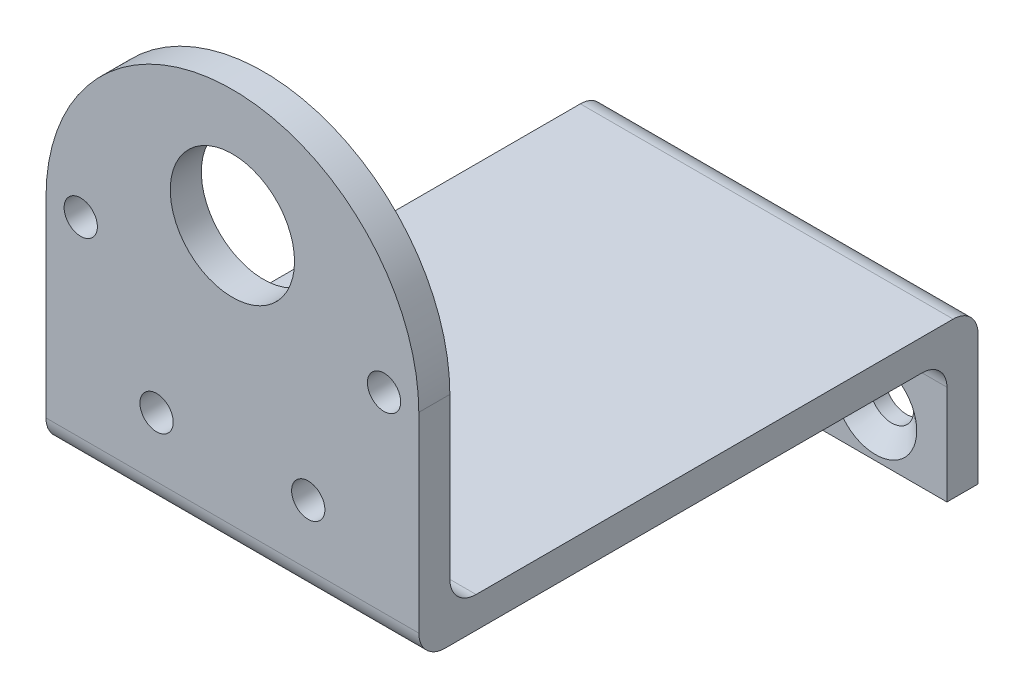
ISO-10303-21;
HEADER;
FILE_DESCRIPTION(('STEP AP214'),'2;1');
FILE_NAME('part.step','',(''),(''),'','','');
FILE_SCHEMA(('AUTOMOTIVE_DESIGN { 1 0 10303 214 1 1 1 1 }'));
ENDSEC;
DATA;
#1=APPLICATION_CONTEXT('core data for automotive mechanical design processes');
#2=APPLICATION_PROTOCOL_DEFINITION('international standard','automotive_design',2000,#1);
#3=PRODUCT_CONTEXT('',#1,'mechanical');
#4=PRODUCT('Part','Part','',(#3));
#5=PRODUCT_RELATED_PRODUCT_CATEGORY('part','',(#4));
#6=PRODUCT_DEFINITION_FORMATION('','',#4);
#7=PRODUCT_DEFINITION_CONTEXT('part definition',#1,'design');
#8=PRODUCT_DEFINITION('design','',#6,#7);
#9=PRODUCT_DEFINITION_SHAPE('','',#8);
#10=(LENGTH_UNIT() NAMED_UNIT(*) SI_UNIT(.MILLI.,.METRE.));
#11=(NAMED_UNIT(*) PLANE_ANGLE_UNIT() SI_UNIT($,.RADIAN.));
#12=(NAMED_UNIT(*) SI_UNIT($,.STERADIAN.) SOLID_ANGLE_UNIT());
#13=UNCERTAINTY_MEASURE_WITH_UNIT(LENGTH_MEASURE(1.E-05),#10,'distance_accuracy_value','');
#14=(GEOMETRIC_REPRESENTATION_CONTEXT(3) GLOBAL_UNCERTAINTY_ASSIGNED_CONTEXT((#13)) GLOBAL_UNIT_ASSIGNED_CONTEXT((#10,
#11,#12)) REPRESENTATION_CONTEXT('',''));
#15=CARTESIAN_POINT('',(0.,0.,0.));
#16=DIRECTION('',(0.,0.,1.));
#17=DIRECTION('',(1.,0.,0.));
#18=AXIS2_PLACEMENT_3D('',#15,#16,#17);
#19=CARTESIAN_POINT('',(38.1,42.094372260743,3.175));
#20=DIRECTION('',(0.,0.,-1.));
#21=DIRECTION('',(0.,1.,0.));
#22=AXIS2_PLACEMENT_3D('',#19,#20,#21);
#23=PLANE('',#22);
#24=CARTESIAN_POINT('',(3.55000000000001,23.044372260743,3.175));
#25=DIRECTION('',(0.,0.,1.));
#26=DIRECTION('',(1.,0.,0.));
#27=AXIS2_PLACEMENT_3D('',#24,#25,#26);
#28=CIRCLE('',#27,1.69999999999999);
#29=CARTESIAN_POINT('',(5.25,23.044372260743,3.175));
#30=VERTEX_POINT('',#29);
#31=EDGE_CURVE('E277',#30,#30,#28,.T.);
#32=ORIENTED_EDGE('',*,*,#31,.F.);
#33=EDGE_LOOP('',(#32));
#34=FACE_BOUND('',#33,.T.);
#35=CARTESIAN_POINT('',(34.55,23.0443722607431,3.175));
#36=DIRECTION('',(0.,0.,1.));
#37=DIRECTION('',(1.,0.,0.));
#38=AXIS2_PLACEMENT_3D('',#35,#36,#37);
#39=CIRCLE('',#38,1.69999999999999);
#40=CARTESIAN_POINT('',(36.25,23.0443722607431,3.175));
#41=VERTEX_POINT('',#40);
#42=EDGE_CURVE('E267',#41,#41,#39,.T.);
#43=ORIENTED_EDGE('',*,*,#42,.F.);
#44=EDGE_LOOP('',(#43));
#45=FACE_BOUND('',#44,.T.);
#46=CARTESIAN_POINT('',(26.8000000000001,9.62097850208426,3.175));
#47=DIRECTION('',(0.,0.,1.));
#48=DIRECTION('',(1.,0.,0.));
#49=AXIS2_PLACEMENT_3D('',#46,#47,#48);
#50=CIRCLE('',#49,1.69999999999999);
#51=CARTESIAN_POINT('',(28.5,9.62097850208426,3.175));
#52=VERTEX_POINT('',#51);
#53=EDGE_CURVE('E264',#52,#52,#50,.T.);
#54=ORIENTED_EDGE('',*,*,#53,.F.);
#55=EDGE_LOOP('',(#54));
#56=FACE_BOUND('',#55,.T.);
#57=CARTESIAN_POINT('',(11.3,9.62097850208421,3.175));
#58=DIRECTION('',(0.,0.,1.));
#59=DIRECTION('',(1.,0.,0.));
#60=AXIS2_PLACEMENT_3D('',#57,#58,#59);
#61=CIRCLE('',#60,1.69999999999999);
#62=CARTESIAN_POINT('',(13.,9.62097850208421,3.175));
#63=VERTEX_POINT('',#62);
#64=EDGE_CURVE('E263',#63,#63,#61,.T.);
#65=ORIENTED_EDGE('',*,*,#64,.F.);
#66=EDGE_LOOP('',(#65));
#67=FACE_BOUND('',#66,.T.);
#68=CARTESIAN_POINT('',(19.05,30.044372260743,3.17499999999999));
#69=DIRECTION('',(0.,0.,1.));
#70=DIRECTION('',(1.,0.,0.));
#71=AXIS2_PLACEMENT_3D('',#68,#69,#70);
#72=CIRCLE('',#71,6.35);
#73=CARTESIAN_POINT('',(25.4,30.044372260743,3.17499999999999));
#74=VERTEX_POINT('',#73);
#75=EDGE_CURVE('E260',#74,#74,#72,.T.);
#76=ORIENTED_EDGE('',*,*,#75,.F.);
#77=EDGE_LOOP('',(#76));
#78=FACE_BOUND('',#77,.T.);
#79=DIRECTION('',(0.,-1.,0.));
#80=VECTOR('',#79,1.);
#81=CARTESIAN_POINT('',(38.1,42.094372260743,3.175));
#82=LINE('',#81,#80);
#83=CARTESIAN_POINT('',(38.1,23.044372260743,3.17499999999999));
#84=VERTEX_POINT('',#83);
#85=CARTESIAN_POINT('',(38.1,3.50032880236569,3.17499999999999));
#86=VERTEX_POINT('',#85);
#87=EDGE_CURVE('E157',#84,#86,#82,.T.);
#88=ORIENTED_EDGE('',*,*,#87,.F.);
#89=CARTESIAN_POINT('',(19.05,23.044372260743,3.17499999999999));
#90=DIRECTION('',(0.,0.,1.));
#91=DIRECTION('',(1.,0.,0.));
#92=AXIS2_PLACEMENT_3D('',#89,#90,#91);
#93=CIRCLE('',#92,19.05);
#94=CARTESIAN_POINT('',(0.,23.044372260743,3.17499999999999));
#95=VERTEX_POINT('',#94);
#96=EDGE_CURVE('E259',#84,#95,#93,.T.);
#97=ORIENTED_EDGE('',*,*,#96,.T.);
#98=DIRECTION('',(0.,-1.,0.));
#99=VECTOR('',#98,1.);
#100=CARTESIAN_POINT('',(0.,42.094372260743,3.175));
#101=LINE('',#100,#99);
#102=CARTESIAN_POINT('',(0.,3.50032880236569,3.17499999999999));
#103=VERTEX_POINT('',#102);
#104=EDGE_CURVE('E212',#95,#103,#101,.T.);
#105=ORIENTED_EDGE('',*,*,#104,.T.);
#106=DIRECTION('',(-1.,0.,0.));
#107=VECTOR('',#106,1.);
#108=CARTESIAN_POINT('',(38.1,3.50032880236569,3.17499999999999));
#109=LINE('',#108,#107);
#110=EDGE_CURVE('E252',#86,#103,#109,.T.);
#111=ORIENTED_EDGE('',*,*,#110,.F.);
#112=EDGE_LOOP('',(#88,#97,#105,#111));
#113=FACE_BOUND('',#112,.T.);
#114=ADVANCED_FACE('F86',(#34,#45,#56,#67,#78,#113),#23,.F.);
#115=CARTESIAN_POINT('',(38.1,42.094372260743,0.));
#116=DIRECTION('',(0.,0.,-1.));
#117=DIRECTION('',(0.,1.,0.));
#118=AXIS2_PLACEMENT_3D('',#115,#116,#117);
#119=PLANE('',#118);
#120=CARTESIAN_POINT('',(3.55000000000001,23.044372260743,0.));
#121=DIRECTION('',(0.,0.,-1.));
#122=DIRECTION('',(0.,1.,0.));
#123=AXIS2_PLACEMENT_3D('',#120,#121,#122);
#124=CIRCLE('',#123,1.69999999999999);
#125=CARTESIAN_POINT('',(3.55000000000001,24.744372260743,0.));
#126=VERTEX_POINT('',#125);
#127=EDGE_CURVE('E89',#126,#126,#124,.T.);
#128=ORIENTED_EDGE('',*,*,#127,.F.);
#129=EDGE_LOOP('',(#128));
#130=FACE_BOUND('',#129,.T.);
#131=CARTESIAN_POINT('',(34.55,23.0443722607431,0.));
#132=DIRECTION('',(0.,0.,-1.));
#133=DIRECTION('',(0.,1.,0.));
#134=AXIS2_PLACEMENT_3D('',#131,#132,#133);
#135=CIRCLE('',#134,1.69999999999999);
#136=CARTESIAN_POINT('',(34.55,24.7443722607431,0.));
#137=VERTEX_POINT('',#136);
#138=EDGE_CURVE('E265',#137,#137,#135,.T.);
#139=ORIENTED_EDGE('',*,*,#138,.F.);
#140=EDGE_LOOP('',(#139));
#141=FACE_BOUND('',#140,.T.);
#142=CARTESIAN_POINT('',(26.8000000000001,9.62097850208426,0.));
#143=DIRECTION('',(0.,0.,-1.));
#144=DIRECTION('',(0.,1.,0.));
#145=AXIS2_PLACEMENT_3D('',#142,#143,#144);
#146=CIRCLE('',#145,1.69999999999999);
#147=CARTESIAN_POINT('',(26.8000000000001,11.3209785020843,0.));
#148=VERTEX_POINT('',#147);
#149=EDGE_CURVE('E261',#148,#148,#146,.T.);
#150=ORIENTED_EDGE('',*,*,#149,.F.);
#151=EDGE_LOOP('',(#150));
#152=FACE_BOUND('',#151,.T.);
#153=CARTESIAN_POINT('',(11.3,9.62097850208421,0.));
#154=DIRECTION('',(0.,0.,-1.));
#155=DIRECTION('',(0.,1.,0.));
#156=AXIS2_PLACEMENT_3D('',#153,#154,#155);
#157=CIRCLE('',#156,1.69999999999999);
#158=CARTESIAN_POINT('',(11.3,11.3209785020842,0.));
#159=VERTEX_POINT('',#158);
#160=EDGE_CURVE('E282',#159,#159,#157,.T.);
#161=ORIENTED_EDGE('',*,*,#160,.F.);
#162=EDGE_LOOP('',(#161));
#163=FACE_BOUND('',#162,.T.);
#164=CARTESIAN_POINT('',(19.05,30.044372260743,0.));
#165=DIRECTION('',(0.,0.,-1.));
#166=DIRECTION('',(0.,1.,0.));
#167=AXIS2_PLACEMENT_3D('',#164,#165,#166);
#168=CIRCLE('',#167,6.35);
#169=CARTESIAN_POINT('',(19.05,36.394372260743,0.));
#170=VERTEX_POINT('',#169);
#171=EDGE_CURVE('E256',#170,#170,#168,.T.);
#172=ORIENTED_EDGE('',*,*,#171,.F.);
#173=EDGE_LOOP('',(#172));
#174=FACE_BOUND('',#173,.T.);
#175=CARTESIAN_POINT('',(19.05,23.044372260743,0.));
#176=DIRECTION('',(0.,0.,-1.));
#177=DIRECTION('',(0.,1.,0.));
#178=AXIS2_PLACEMENT_3D('',#175,#176,#177);
#179=CIRCLE('',#178,19.05);
#180=CARTESIAN_POINT('',(0.,23.044372260743,0.));
#181=VERTEX_POINT('',#180);
#182=CARTESIAN_POINT('',(38.1,23.044372260743,0.));
#183=VERTEX_POINT('',#182);
#184=EDGE_CURVE('E102',#181,#183,#179,.T.);
#185=ORIENTED_EDGE('',*,*,#184,.T.);
#186=DIRECTION('',(0.,-1.,0.));
#187=VECTOR('',#186,1.);
#188=CARTESIAN_POINT('',(38.1,42.094372260743,0.));
#189=LINE('',#188,#187);
#190=CARTESIAN_POINT('',(38.1,6.6753288023657,0.));
#191=VERTEX_POINT('',#190);
#192=EDGE_CURVE('E110',#183,#191,#189,.T.);
#193=ORIENTED_EDGE('',*,*,#192,.T.);
#194=DIRECTION('',(-1.,0.,0.));
#195=VECTOR('',#194,1.);
#196=CARTESIAN_POINT('',(38.1,6.6753288023657,0.));
#197=LINE('',#196,#195);
#198=CARTESIAN_POINT('',(0.,6.6753288023657,0.));
#199=VERTEX_POINT('',#198);
#200=EDGE_CURVE('E211',#191,#199,#197,.T.);
#201=ORIENTED_EDGE('',*,*,#200,.T.);
#202=DIRECTION('',(0.,-1.,0.));
#203=VECTOR('',#202,1.);
#204=CARTESIAN_POINT('',(0.,42.094372260743,0.));
#205=LINE('',#204,#203);
#206=EDGE_CURVE('E150',#181,#199,#205,.T.);
#207=ORIENTED_EDGE('',*,*,#206,.F.);
#208=EDGE_LOOP('',(#185,#193,#201,#207));
#209=FACE_BOUND('',#208,.T.);
#210=ADVANCED_FACE('F366',(#130,#141,#152,#163,#174,#209),#119,.T.);
#211=CARTESIAN_POINT('',(38.1,3.50032880236569,0.494043458377322));
#212=DIRECTION('',(1.,0.,0.));
#213=DIRECTION('',(0.,0.,-1.));
#214=AXIS2_PLACEMENT_3D('',#211,#212,#213);
#215=PLANE('',#214);
#216=ORIENTED_EDGE('',*,*,#192,.F.);
#217=DIRECTION('',(0.,0.,1.));
#218=VECTOR('',#217,1.);
#219=CARTESIAN_POINT('',(38.1,23.044372260743,-53.975));
#220=LINE('',#219,#218);
#221=EDGE_CURVE('E12',#183,#84,#220,.T.);
#222=ORIENTED_EDGE('',*,*,#221,.T.);
#223=ORIENTED_EDGE('',*,*,#87,.T.);
#224=CARTESIAN_POINT('',(38.1,3.50032880236569,0.494043458377322));
#225=DIRECTION('',(1.,0.,0.));
#226=DIRECTION('',(0.,0.,-1.));
#227=AXIS2_PLACEMENT_3D('',#224,#225,#226);
#228=CIRCLE('',#227,2.68095654162267);
#229=CARTESIAN_POINT('',(38.1,0.81937226074302,0.494043458377322));
#230=VERTEX_POINT('',#229);
#231=EDGE_CURVE('E308',#86,#230,#228,.T.);
#232=ORIENTED_EDGE('',*,*,#231,.T.);
#233=DIRECTION('',(0.,0.,-1.));
#234=VECTOR('',#233,1.);
#235=CARTESIAN_POINT('',(38.1,0.81937226074302,0.494043458377322));
#236=LINE('',#235,#234);
#237=CARTESIAN_POINT('',(38.1,0.819372260743023,-48.26));
#238=VERTEX_POINT('',#237);
#239=EDGE_CURVE('E310',#230,#238,#236,.T.);
#240=ORIENTED_EDGE('',*,*,#239,.T.);
#241=CARTESIAN_POINT('',(38.1,-1.72062773925698,-48.26));
#242=DIRECTION('',(-1.,0.,0.));
#243=DIRECTION('',(0.,0.,1.));
#244=AXIS2_PLACEMENT_3D('',#241,#242,#243);
#245=CIRCLE('',#244,2.54);
#246=CARTESIAN_POINT('',(38.1,-1.72062773925698,-50.8));
#247=VERTEX_POINT('',#246);
#248=EDGE_CURVE('E312',#238,#247,#245,.T.);
#249=ORIENTED_EDGE('',*,*,#248,.T.);
#250=DIRECTION('',(0.,1.,0.));
#251=VECTOR('',#250,1.);
#252=CARTESIAN_POINT('',(38.1,-11.880627739257,-50.8));
#253=LINE('',#252,#251);
#254=CARTESIAN_POINT('',(38.1,-11.880627739257,-50.8));
#255=VERTEX_POINT('',#254);
#256=EDGE_CURVE('E314',#255,#247,#253,.T.);
#257=ORIENTED_EDGE('',*,*,#256,.F.);
#258=DIRECTION('',(0.,0.,1.));
#259=VECTOR('',#258,1.);
#260=CARTESIAN_POINT('',(38.1,-11.880627739257,-53.975));
#261=LINE('',#260,#259);
#262=CARTESIAN_POINT('',(38.1,-11.880627739257,-53.975));
#263=VERTEX_POINT('',#262);
#264=EDGE_CURVE('E317',#263,#255,#261,.T.);
#265=ORIENTED_EDGE('',*,*,#264,.F.);
#266=DIRECTION('',(0.,-1.,0.));
#267=VECTOR('',#266,1.);
#268=CARTESIAN_POINT('',(38.1,1.45437226074302,-53.975));
#269=LINE('',#268,#267);
#270=CARTESIAN_POINT('',(38.1,1.45437226074302,-53.975));
#271=VERTEX_POINT('',#270);
#272=EDGE_CURVE('E202',#271,#263,#269,.T.);
#273=ORIENTED_EDGE('',*,*,#272,.F.);
#274=CARTESIAN_POINT('',(38.1,1.45437226074302,-51.435));
#275=DIRECTION('',(-1.,0.,0.));
#276=DIRECTION('',(0.,0.,1.));
#277=AXIS2_PLACEMENT_3D('',#274,#275,#276);
#278=CIRCLE('',#277,2.54);
#279=CARTESIAN_POINT('',(38.1,3.99437226074302,-51.435));
#280=VERTEX_POINT('',#279);
#281=EDGE_CURVE('E184',#280,#271,#278,.T.);
#282=ORIENTED_EDGE('',*,*,#281,.F.);
#283=DIRECTION('',(0.,0.,-1.));
#284=VECTOR('',#283,1.);
#285=CARTESIAN_POINT('',(38.1,3.99437226074302,-2.68095654162268));
#286=LINE('',#285,#284);
#287=CARTESIAN_POINT('',(38.1,3.99437226074302,-2.68095654162268));
#288=VERTEX_POINT('',#287);
#289=EDGE_CURVE('E198',#288,#280,#286,.T.);
#290=ORIENTED_EDGE('',*,*,#289,.F.);
#291=CARTESIAN_POINT('',(38.1,6.6753288023657,-2.68095654162268));
#292=DIRECTION('',(1.,0.,0.));
#293=DIRECTION('',(0.,0.,-1.));
#294=AXIS2_PLACEMENT_3D('',#291,#292,#293);
#295=CIRCLE('',#294,2.68095654162267);
#296=EDGE_CURVE('E205',#191,#288,#295,.T.);
#297=ORIENTED_EDGE('',*,*,#296,.F.);
#298=EDGE_LOOP('',(#216,#222,#223,#232,#240,#249,#257,#265,#273,#282,#290,#297));
#299=FACE_BOUND('',#298,.T.);
#300=ADVANCED_FACE('F196',(#299),#215,.T.);
#301=CARTESIAN_POINT('',(0.,3.50032880236569,0.494043458377322));
#302=DIRECTION('',(1.,0.,0.));
#303=DIRECTION('',(0.,0.,-1.));
#304=AXIS2_PLACEMENT_3D('',#301,#302,#303);
#305=PLANE('',#304);
#306=DIRECTION('',(0.,0.,1.));
#307=VECTOR('',#306,1.);
#308=CARTESIAN_POINT('',(0.,23.044372260743,-53.975));
#309=LINE('',#308,#307);
#310=EDGE_CURVE('E94',#181,#95,#309,.T.);
#311=ORIENTED_EDGE('',*,*,#310,.F.);
#312=ORIENTED_EDGE('',*,*,#206,.T.);
#313=CARTESIAN_POINT('',(0.,6.6753288023657,-2.68095654162268));
#314=DIRECTION('',(1.,0.,0.));
#315=DIRECTION('',(0.,0.,-1.));
#316=AXIS2_PLACEMENT_3D('',#313,#314,#315);
#317=CIRCLE('',#316,2.68095654162267);
#318=CARTESIAN_POINT('',(0.,3.99437226074302,-2.68095654162268));
#319=VERTEX_POINT('',#318);
#320=EDGE_CURVE('E234',#199,#319,#317,.T.);
#321=ORIENTED_EDGE('',*,*,#320,.T.);
#322=DIRECTION('',(0.,0.,-1.));
#323=VECTOR('',#322,1.);
#324=CARTESIAN_POINT('',(0.,3.99437226074302,-2.68095654162268));
#325=LINE('',#324,#323);
#326=CARTESIAN_POINT('',(0.,3.99437226074302,-51.435));
#327=VERTEX_POINT('',#326);
#328=EDGE_CURVE('E232',#319,#327,#325,.T.);
#329=ORIENTED_EDGE('',*,*,#328,.T.);
#330=CARTESIAN_POINT('',(0.,1.45437226074302,-51.435));
#331=DIRECTION('',(-1.,0.,0.));
#332=DIRECTION('',(0.,0.,1.));
#333=AXIS2_PLACEMENT_3D('',#330,#331,#332);
#334=CIRCLE('',#333,2.54);
#335=CARTESIAN_POINT('',(0.,1.45437226074302,-53.975));
#336=VERTEX_POINT('',#335);
#337=EDGE_CURVE('E186',#327,#336,#334,.T.);
#338=ORIENTED_EDGE('',*,*,#337,.T.);
#339=DIRECTION('',(0.,-1.,0.));
#340=VECTOR('',#339,1.);
#341=CARTESIAN_POINT('',(0.,1.45437226074302,-53.975));
#342=LINE('',#341,#340);
#343=CARTESIAN_POINT('',(0.,-11.880627739257,-53.975));
#344=VERTEX_POINT('',#343);
#345=EDGE_CURVE('E228',#336,#344,#342,.T.);
#346=ORIENTED_EDGE('',*,*,#345,.T.);
#347=DIRECTION('',(0.,0.,1.));
#348=VECTOR('',#347,1.);
#349=CARTESIAN_POINT('',(0.,-11.880627739257,-53.975));
#350=LINE('',#349,#348);
#351=CARTESIAN_POINT('',(0.,-11.880627739257,-50.8));
#352=VERTEX_POINT('',#351);
#353=EDGE_CURVE('E225',#344,#352,#350,.T.);
#354=ORIENTED_EDGE('',*,*,#353,.T.);
#355=DIRECTION('',(0.,1.,0.));
#356=VECTOR('',#355,1.);
#357=CARTESIAN_POINT('',(0.,-11.880627739257,-50.8));
#358=LINE('',#357,#356);
#359=CARTESIAN_POINT('',(0.,-1.72062773925698,-50.8));
#360=VERTEX_POINT('',#359);
#361=EDGE_CURVE('E222',#352,#360,#358,.T.);
#362=ORIENTED_EDGE('',*,*,#361,.T.);
#363=CARTESIAN_POINT('',(0.,-1.72062773925698,-48.26));
#364=DIRECTION('',(-1.,0.,0.));
#365=DIRECTION('',(0.,0.,1.));
#366=AXIS2_PLACEMENT_3D('',#363,#364,#365);
#367=CIRCLE('',#366,2.54);
#368=CARTESIAN_POINT('',(0.,0.819372260743023,-48.26));
#369=VERTEX_POINT('',#368);
#370=EDGE_CURVE('E219',#369,#360,#367,.T.);
#371=ORIENTED_EDGE('',*,*,#370,.F.);
#372=DIRECTION('',(0.,0.,-1.));
#373=VECTOR('',#372,1.);
#374=CARTESIAN_POINT('',(0.,0.81937226074302,0.494043458377322));
#375=LINE('',#374,#373);
#376=CARTESIAN_POINT('',(0.,0.81937226074302,0.494043458377322));
#377=VERTEX_POINT('',#376);
#378=EDGE_CURVE('E217',#377,#369,#375,.T.);
#379=ORIENTED_EDGE('',*,*,#378,.F.);
#380=CARTESIAN_POINT('',(0.,3.50032880236569,0.494043458377322));
#381=DIRECTION('',(1.,0.,0.));
#382=DIRECTION('',(0.,0.,-1.));
#383=AXIS2_PLACEMENT_3D('',#380,#381,#382);
#384=CIRCLE('',#383,2.68095654162267);
#385=EDGE_CURVE('E214',#103,#377,#384,.T.);
#386=ORIENTED_EDGE('',*,*,#385,.F.);
#387=ORIENTED_EDGE('',*,*,#104,.F.);
#388=EDGE_LOOP('',(#311,#312,#321,#329,#338,#346,#354,#362,#371,#379,#386,#387));
#389=FACE_BOUND('',#388,.T.);
#390=ADVANCED_FACE('F323',(#389),#305,.F.);
#391=CARTESIAN_POINT('',(38.1,3.50032880236569,0.494043458377322));
#392=DIRECTION('',(-1.,0.,0.));
#393=DIRECTION('',(0.,0.,1.));
#394=AXIS2_PLACEMENT_3D('',#391,#392,#393);
#395=CYLINDRICAL_SURFACE('',#394,2.68095654162267);
#396=ORIENTED_EDGE('',*,*,#385,.T.);
#397=DIRECTION('',(-1.,0.,0.));
#398=VECTOR('',#397,1.);
#399=CARTESIAN_POINT('',(38.1,0.81937226074302,0.494043458377322));
#400=LINE('',#399,#398);
#401=EDGE_CURVE('E249',#230,#377,#400,.T.);
#402=ORIENTED_EDGE('',*,*,#401,.F.);
#403=ORIENTED_EDGE('',*,*,#231,.F.);
#404=ORIENTED_EDGE('',*,*,#110,.T.);
#405=EDGE_LOOP('',(#396,#402,#403,#404));
#406=FACE_BOUND('',#405,.T.);
#407=ADVANCED_FACE('F339',(#406),#395,.T.);
#408=CARTESIAN_POINT('',(38.1,0.81937226074302,0.494043458377322));
#409=DIRECTION('',(0.,1.,0.));
#410=DIRECTION('',(0.,0.,1.));
#411=AXIS2_PLACEMENT_3D('',#408,#409,#410);
#412=PLANE('',#411);
#413=ORIENTED_EDGE('',*,*,#378,.T.);
#414=DIRECTION('',(-1.,0.,0.));
#415=VECTOR('',#414,1.);
#416=CARTESIAN_POINT('',(38.1,0.819372260743023,-48.26));
#417=LINE('',#416,#415);
#418=EDGE_CURVE('E246',#238,#369,#417,.T.);
#419=ORIENTED_EDGE('',*,*,#418,.F.);
#420=ORIENTED_EDGE('',*,*,#239,.F.);
#421=ORIENTED_EDGE('',*,*,#401,.T.);
#422=EDGE_LOOP('',(#413,#419,#420,#421));
#423=FACE_BOUND('',#422,.T.);
#424=ADVANCED_FACE('F343',(#423),#412,.F.);
#425=CARTESIAN_POINT('',(38.1,-1.72062773925698,-48.26));
#426=DIRECTION('',(-1.,0.,0.));
#427=DIRECTION('',(0.,0.,1.));
#428=AXIS2_PLACEMENT_3D('',#425,#426,#427);
#429=CYLINDRICAL_SURFACE('',#428,2.54);
#430=ORIENTED_EDGE('',*,*,#370,.T.);
#431=DIRECTION('',(-1.,0.,0.));
#432=VECTOR('',#431,1.);
#433=CARTESIAN_POINT('',(38.1,-1.72062773925698,-50.8));
#434=LINE('',#433,#432);
#435=EDGE_CURVE('E244',#247,#360,#434,.T.);
#436=ORIENTED_EDGE('',*,*,#435,.F.);
#437=ORIENTED_EDGE('',*,*,#248,.F.);
#438=ORIENTED_EDGE('',*,*,#418,.T.);
#439=EDGE_LOOP('',(#430,#436,#437,#438));
#440=FACE_BOUND('',#439,.T.);
#441=ADVANCED_FACE('F349',(#440),#429,.F.);
#442=CARTESIAN_POINT('',(38.1,-11.880627739257,-50.8));
#443=DIRECTION('',(0.,0.,1.));
#444=DIRECTION('',(0.,-1.,0.));
#445=AXIS2_PLACEMENT_3D('',#442,#443,#444);
#446=PLANE('',#445);
#447=CARTESIAN_POINT('',(7.3025,-7.11812773925698,-50.8));
#448=DIRECTION('',(0.,0.,1.));
#449=DIRECTION('',(1.,0.,0.));
#450=AXIS2_PLACEMENT_3D('',#447,#448,#449);
#451=CIRCLE('',#450,4.2164);
#452=CARTESIAN_POINT('',(11.5189,-7.11812773925698,-50.8));
#453=VERTEX_POINT('',#452);
#454=EDGE_CURVE('E290',#453,#453,#451,.T.);
#455=ORIENTED_EDGE('',*,*,#454,.F.);
#456=EDGE_LOOP('',(#455));
#457=FACE_BOUND('',#456,.T.);
#458=CARTESIAN_POINT('',(30.7975,-7.11812773925698,-50.8));
#459=DIRECTION('',(0.,0.,1.));
#460=DIRECTION('',(1.,0.,0.));
#461=AXIS2_PLACEMENT_3D('',#458,#459,#460);
#462=CIRCLE('',#461,4.2164);
#463=CARTESIAN_POINT('',(35.0139,-7.11812773925698,-50.8));
#464=VERTEX_POINT('',#463);
#465=EDGE_CURVE('E299',#464,#464,#462,.T.);
#466=ORIENTED_EDGE('',*,*,#465,.F.);
#467=EDGE_LOOP('',(#466));
#468=FACE_BOUND('',#467,.T.);
#469=ORIENTED_EDGE('',*,*,#361,.F.);
#470=DIRECTION('',(-1.,0.,0.));
#471=VECTOR('',#470,1.);
#472=CARTESIAN_POINT('',(38.1,-11.880627739257,-50.8));
#473=LINE('',#472,#471);
#474=EDGE_CURVE('E242',#255,#352,#473,.T.);
#475=ORIENTED_EDGE('',*,*,#474,.F.);
#476=ORIENTED_EDGE('',*,*,#256,.T.);
#477=ORIENTED_EDGE('',*,*,#435,.T.);
#478=EDGE_LOOP('',(#469,#475,#476,#477));
#479=FACE_BOUND('',#478,.T.);
#480=ADVANCED_FACE('F352',(#457,#468,#479),#446,.T.);
#481=CARTESIAN_POINT('',(38.1,-11.880627739257,-53.975));
#482=DIRECTION('',(0.,-1.,0.));
#483=DIRECTION('',(0.,0.,-1.));
#484=AXIS2_PLACEMENT_3D('',#481,#482,#483);
#485=PLANE('',#484);
#486=ORIENTED_EDGE('',*,*,#353,.F.);
#487=DIRECTION('',(-1.,0.,0.));
#488=VECTOR('',#487,1.);
#489=CARTESIAN_POINT('',(38.1,-11.880627739257,-53.975));
#490=LINE('',#489,#488);
#491=EDGE_CURVE('E240',#263,#344,#490,.T.);
#492=ORIENTED_EDGE('',*,*,#491,.F.);
#493=ORIENTED_EDGE('',*,*,#264,.T.);
#494=ORIENTED_EDGE('',*,*,#474,.T.);
#495=EDGE_LOOP('',(#486,#492,#493,#494));
#496=FACE_BOUND('',#495,.T.);
#497=ADVANCED_FACE('F354',(#496),#485,.T.);
#498=CARTESIAN_POINT('',(38.1,1.45437226074302,-53.975));
#499=DIRECTION('',(0.,0.,-1.));
#500=DIRECTION('',(0.,1.,0.));
#501=AXIS2_PLACEMENT_3D('',#498,#499,#500);
#502=PLANE('',#501);
#503=CARTESIAN_POINT('',(7.3025,-7.11812773925698,-53.975));
#504=DIRECTION('',(0.,0.,1.));
#505=DIRECTION('',(1.,0.,0.));
#506=AXIS2_PLACEMENT_3D('',#503,#504,#505);
#507=CIRCLE('',#506,2.2479);
#508=CARTESIAN_POINT('',(9.55039999999999,-7.11812773925698,-53.975));
#509=VERTEX_POINT('',#508);
#510=EDGE_CURVE('E296',#509,#509,#507,.T.);
#511=ORIENTED_EDGE('',*,*,#510,.T.);
#512=EDGE_LOOP('',(#511));
#513=FACE_BOUND('',#512,.T.);
#514=CARTESIAN_POINT('',(30.7975,-7.11812773925698,-53.975));
#515=DIRECTION('',(0.,0.,1.));
#516=DIRECTION('',(1.,0.,0.));
#517=AXIS2_PLACEMENT_3D('',#514,#515,#516);
#518=CIRCLE('',#517,2.2479);
#519=CARTESIAN_POINT('',(33.0454,-7.11812773925698,-53.975));
#520=VERTEX_POINT('',#519);
#521=EDGE_CURVE('E215',#520,#520,#518,.T.);
#522=ORIENTED_EDGE('',*,*,#521,.T.);
#523=EDGE_LOOP('',(#522));
#524=FACE_BOUND('',#523,.T.);
#525=ORIENTED_EDGE('',*,*,#345,.F.);
#526=DIRECTION('',(-1.,0.,0.));
#527=VECTOR('',#526,1.);
#528=CARTESIAN_POINT('',(38.1,1.45437226074302,-53.975));
#529=LINE('',#528,#527);
#530=EDGE_CURVE('E191',#271,#336,#529,.T.);
#531=ORIENTED_EDGE('',*,*,#530,.F.);
#532=ORIENTED_EDGE('',*,*,#272,.T.);
#533=ORIENTED_EDGE('',*,*,#491,.T.);
#534=EDGE_LOOP('',(#525,#531,#532,#533));
#535=FACE_BOUND('',#534,.T.);
#536=ADVANCED_FACE('F321',(#513,#524,#535),#502,.T.);
#537=CARTESIAN_POINT('',(38.1,1.45437226074302,-51.435));
#538=DIRECTION('',(-1.,0.,0.));
#539=DIRECTION('',(0.,0.,1.));
#540=AXIS2_PLACEMENT_3D('',#537,#538,#539);
#541=CYLINDRICAL_SURFACE('',#540,2.54);
#542=ORIENTED_EDGE('',*,*,#337,.F.);
#543=DIRECTION('',(-1.,0.,0.));
#544=VECTOR('',#543,1.);
#545=CARTESIAN_POINT('',(38.1,3.99437226074302,-51.435));
#546=LINE('',#545,#544);
#547=EDGE_CURVE('E181',#280,#327,#546,.T.);
#548=ORIENTED_EDGE('',*,*,#547,.F.);
#549=ORIENTED_EDGE('',*,*,#281,.T.);
#550=ORIENTED_EDGE('',*,*,#530,.T.);
#551=EDGE_LOOP('',(#542,#548,#549,#550));
#552=FACE_BOUND('',#551,.T.);
#553=ADVANCED_FACE('F183',(#552),#541,.T.);
#554=CARTESIAN_POINT('',(38.1,3.99437226074302,-2.68095654162268));
#555=DIRECTION('',(0.,1.,0.));
#556=DIRECTION('',(0.,0.,1.));
#557=AXIS2_PLACEMENT_3D('',#554,#555,#556);
#558=PLANE('',#557);
#559=ORIENTED_EDGE('',*,*,#328,.F.);
#560=DIRECTION('',(-1.,0.,0.));
#561=VECTOR('',#560,1.);
#562=CARTESIAN_POINT('',(38.1,3.99437226074302,-2.68095654162268));
#563=LINE('',#562,#561);
#564=EDGE_CURVE('E192',#288,#319,#563,.T.);
#565=ORIENTED_EDGE('',*,*,#564,.F.);
#566=ORIENTED_EDGE('',*,*,#289,.T.);
#567=ORIENTED_EDGE('',*,*,#547,.T.);
#568=EDGE_LOOP('',(#559,#565,#566,#567));
#569=FACE_BOUND('',#568,.T.);
#570=ADVANCED_FACE('F204',(#569),#558,.T.);
#571=CARTESIAN_POINT('',(38.1,6.6753288023657,-2.68095654162268));
#572=DIRECTION('',(-1.,0.,0.));
#573=DIRECTION('',(0.,0.,1.));
#574=AXIS2_PLACEMENT_3D('',#571,#572,#573);
#575=CYLINDRICAL_SURFACE('',#574,2.68095654162267);
#576=ORIENTED_EDGE('',*,*,#320,.F.);
#577=ORIENTED_EDGE('',*,*,#200,.F.);
#578=ORIENTED_EDGE('',*,*,#296,.T.);
#579=ORIENTED_EDGE('',*,*,#564,.T.);
#580=EDGE_LOOP('',(#576,#577,#578,#579));
#581=FACE_BOUND('',#580,.T.);
#582=ADVANCED_FACE('F326',(#581),#575,.F.);
#583=CARTESIAN_POINT('',(30.7975,-7.11812773925698,-50.8));
#584=DIRECTION('',(0.,0.,1.));
#585=DIRECTION('',(1.,0.,0.));
#586=AXIS2_PLACEMENT_3D('',#583,#584,#585);
#587=CYLINDRICAL_SURFACE('',#586,2.24789999999999);
#588=ORIENTED_EDGE('',*,*,#521,.F.);
#589=EDGE_LOOP('',(#588));
#590=FACE_BOUND('',#589,.T.);
#591=CARTESIAN_POINT('',(30.7975,-7.11812773925698,-52.4517676239725));
#592=DIRECTION('',(0.,0.,1.));
#593=DIRECTION('',(1.,0.,0.));
#594=AXIS2_PLACEMENT_3D('',#591,#592,#593);
#595=CIRCLE('',#594,2.24789999999999);
#596=CARTESIAN_POINT('',(33.0454,-7.11812773925698,-52.4517676239725));
#597=VERTEX_POINT('',#596);
#598=EDGE_CURVE('E302',#597,#597,#595,.T.);
#599=ORIENTED_EDGE('',*,*,#598,.T.);
#600=EDGE_LOOP('',(#599));
#601=FACE_BOUND('',#600,.T.);
#602=ADVANCED_FACE('F409',(#590,#601),#587,.F.);
#603=CARTESIAN_POINT('',(30.7975,-7.11812773925698,-50.8));
#604=DIRECTION('',(0.,0.,1.));
#605=DIRECTION('',(1.,0.,0.));
#606=AXIS2_PLACEMENT_3D('',#603,#604,#605);
#607=CONICAL_SURFACE('',#606,4.2164,0.87266462599717);
#608=ORIENTED_EDGE('',*,*,#598,.F.);
#609=EDGE_LOOP('',(#608));
#610=FACE_BOUND('',#609,.T.);
#611=ORIENTED_EDGE('',*,*,#465,.T.);
#612=EDGE_LOOP('',(#611));
#613=FACE_BOUND('',#612,.T.);
#614=ADVANCED_FACE('F405',(#610,#613),#607,.F.);
#615=CARTESIAN_POINT('',(7.3025,-7.11812773925698,-50.8));
#616=DIRECTION('',(0.,0.,1.));
#617=DIRECTION('',(1.,0.,0.));
#618=AXIS2_PLACEMENT_3D('',#615,#616,#617);
#619=CYLINDRICAL_SURFACE('',#618,2.24789999999999);
#620=ORIENTED_EDGE('',*,*,#510,.F.);
#621=EDGE_LOOP('',(#620));
#622=FACE_BOUND('',#621,.T.);
#623=CARTESIAN_POINT('',(7.3025,-7.11812773925698,-52.4517676239725));
#624=DIRECTION('',(0.,0.,1.));
#625=DIRECTION('',(1.,0.,0.));
#626=AXIS2_PLACEMENT_3D('',#623,#624,#625);
#627=CIRCLE('',#626,2.24789999999999);
#628=CARTESIAN_POINT('',(9.55039999999998,-7.11812773925698,-52.4517676239725));
#629=VERTEX_POINT('',#628);
#630=EDGE_CURVE('E293',#629,#629,#627,.T.);
#631=ORIENTED_EDGE('',*,*,#630,.T.);
#632=EDGE_LOOP('',(#631));
#633=FACE_BOUND('',#632,.T.);
#634=ADVANCED_FACE('F401',(#622,#633),#619,.F.);
#635=CARTESIAN_POINT('',(7.3025,-7.11812773925698,-50.8));
#636=DIRECTION('',(0.,0.,1.));
#637=DIRECTION('',(1.,0.,0.));
#638=AXIS2_PLACEMENT_3D('',#635,#636,#637);
#639=CONICAL_SURFACE('',#638,4.2164,0.87266462599717);
#640=ORIENTED_EDGE('',*,*,#630,.F.);
#641=EDGE_LOOP('',(#640));
#642=FACE_BOUND('',#641,.T.);
#643=ORIENTED_EDGE('',*,*,#454,.T.);
#644=EDGE_LOOP('',(#643));
#645=FACE_BOUND('',#644,.T.);
#646=ADVANCED_FACE('F395',(#642,#645),#639,.F.);
#647=CARTESIAN_POINT('',(19.05,23.044372260743,-53.975));
#648=DIRECTION('',(0.,0.,1.));
#649=DIRECTION('',(1.,0.,0.));
#650=AXIS2_PLACEMENT_3D('',#647,#648,#649);
#651=CYLINDRICAL_SURFACE('',#650,19.05);
#652=ORIENTED_EDGE('',*,*,#310,.T.);
#653=ORIENTED_EDGE('',*,*,#96,.F.);
#654=ORIENTED_EDGE('',*,*,#221,.F.);
#655=ORIENTED_EDGE('',*,*,#184,.F.);
#656=EDGE_LOOP('',(#652,#653,#654,#655));
#657=FACE_BOUND('',#656,.T.);
#658=ADVANCED_FACE('F331',(#657),#651,.T.);
#659=CARTESIAN_POINT('',(19.05,30.044372260743,-53.975));
#660=DIRECTION('',(0.,0.,1.));
#661=DIRECTION('',(1.,0.,0.));
#662=AXIS2_PLACEMENT_3D('',#659,#660,#661);
#663=CYLINDRICAL_SURFACE('',#662,6.35);
#664=ORIENTED_EDGE('',*,*,#171,.T.);
#665=EDGE_LOOP('',(#664));
#666=FACE_BOUND('',#665,.T.);
#667=ORIENTED_EDGE('',*,*,#75,.T.);
#668=EDGE_LOOP('',(#667));
#669=FACE_BOUND('',#668,.T.);
#670=ADVANCED_FACE('F383',(#666,#669),#663,.F.);
#671=CARTESIAN_POINT('',(11.3,9.62097850208421,3.17499999999999));
#672=DIRECTION('',(0.,0.,1.));
#673=DIRECTION('',(1.,0.,0.));
#674=AXIS2_PLACEMENT_3D('',#671,#672,#673);
#675=CYLINDRICAL_SURFACE('',#674,1.69999999999999);
#676=ORIENTED_EDGE('',*,*,#160,.T.);
#677=EDGE_LOOP('',(#676));
#678=FACE_BOUND('',#677,.T.);
#679=ORIENTED_EDGE('',*,*,#64,.T.);
#680=EDGE_LOOP('',(#679));
#681=FACE_BOUND('',#680,.T.);
#682=ADVANCED_FACE('F385',(#678,#681),#675,.F.);
#683=CARTESIAN_POINT('',(26.8000000000001,9.62097850208426,3.17499999999999));
#684=DIRECTION('',(0.,0.,1.));
#685=DIRECTION('',(1.,0.,0.));
#686=AXIS2_PLACEMENT_3D('',#683,#684,#685);
#687=CYLINDRICAL_SURFACE('',#686,1.69999999999999);
#688=ORIENTED_EDGE('',*,*,#149,.T.);
#689=EDGE_LOOP('',(#688));
#690=FACE_BOUND('',#689,.T.);
#691=ORIENTED_EDGE('',*,*,#53,.T.);
#692=EDGE_LOOP('',(#691));
#693=FACE_BOUND('',#692,.T.);
#694=ADVANCED_FACE('F392',(#690,#693),#687,.F.);
#695=CARTESIAN_POINT('',(34.55,23.0443722607431,3.17499999999999));
#696=DIRECTION('',(0.,0.,1.));
#697=DIRECTION('',(1.,0.,0.));
#698=AXIS2_PLACEMENT_3D('',#695,#696,#697);
#699=CYLINDRICAL_SURFACE('',#698,1.69999999999999);
#700=ORIENTED_EDGE('',*,*,#138,.T.);
#701=EDGE_LOOP('',(#700));
#702=FACE_BOUND('',#701,.T.);
#703=ORIENTED_EDGE('',*,*,#42,.T.);
#704=EDGE_LOOP('',(#703));
#705=FACE_BOUND('',#704,.T.);
#706=ADVANCED_FACE('F492',(#702,#705),#699,.F.);
#707=CARTESIAN_POINT('',(3.55000000000001,23.044372260743,3.17499999999999));
#708=DIRECTION('',(0.,0.,1.));
#709=DIRECTION('',(1.,0.,0.));
#710=AXIS2_PLACEMENT_3D('',#707,#708,#709);
#711=CYLINDRICAL_SURFACE('',#710,1.69999999999999);
#712=ORIENTED_EDGE('',*,*,#127,.T.);
#713=EDGE_LOOP('',(#712));
#714=FACE_BOUND('',#713,.T.);
#715=ORIENTED_EDGE('',*,*,#31,.T.);
#716=EDGE_LOOP('',(#715));
#717=FACE_BOUND('',#716,.T.);
#718=ADVANCED_FACE('F501',(#714,#717),#711,.F.);
#719=CLOSED_SHELL('',(#114,#210,#300,#390,#407,#424,#441,#480,#497,#536,#553,#570,#582,#602,
#614,#634,#646,#658,#670,#682,#694,#706,#718));
#720=MANIFOLD_SOLID_BREP('B2',#719);
#721=ADVANCED_BREP_SHAPE_REPRESENTATION('',(#18,#720),#14);
#722=SHAPE_DEFINITION_REPRESENTATION(#9,#721);
ENDSEC;
END-ISO-10303-21;
